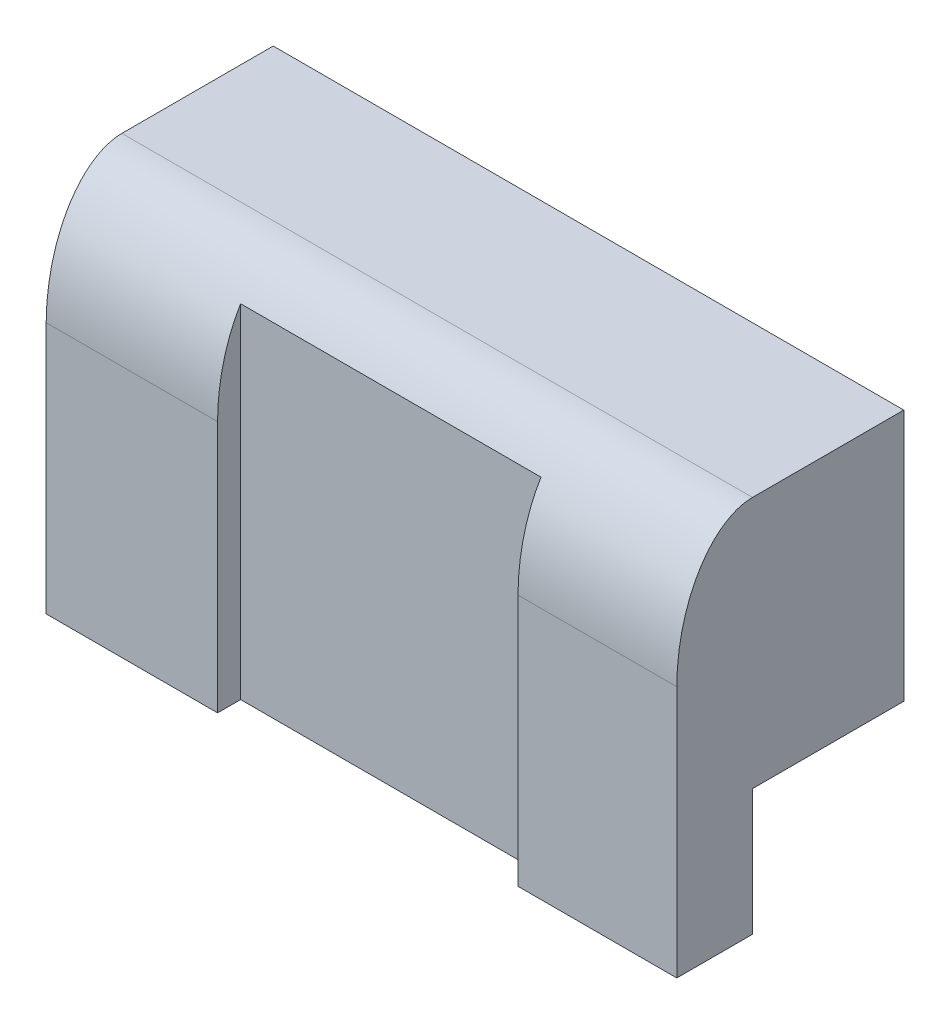
ISO-10303-21;
HEADER;
FILE_DESCRIPTION(('STEP AP214'),'2;1');
FILE_NAME('part.step','',(''),(''),'','','');
FILE_SCHEMA(('AUTOMOTIVE_DESIGN { 1 0 10303 214 1 1 1 1 }'));
ENDSEC;
DATA;
#1=APPLICATION_CONTEXT('core data for automotive mechanical design processes');
#2=APPLICATION_PROTOCOL_DEFINITION('international standard','automotive_design',2000,#1);
#3=PRODUCT_CONTEXT('',#1,'mechanical');
#4=PRODUCT('Part','Part','',(#3));
#5=PRODUCT_RELATED_PRODUCT_CATEGORY('part','',(#4));
#6=PRODUCT_DEFINITION_FORMATION('','',#4);
#7=PRODUCT_DEFINITION_CONTEXT('part definition',#1,'design');
#8=PRODUCT_DEFINITION('design','',#6,#7);
#9=PRODUCT_DEFINITION_SHAPE('','',#8);
#10=(LENGTH_UNIT() NAMED_UNIT(*) SI_UNIT(.MILLI.,.METRE.));
#11=(NAMED_UNIT(*) PLANE_ANGLE_UNIT() SI_UNIT($,.RADIAN.));
#12=(NAMED_UNIT(*) SI_UNIT($,.STERADIAN.) SOLID_ANGLE_UNIT());
#13=UNCERTAINTY_MEASURE_WITH_UNIT(LENGTH_MEASURE(1.E-05),#10,'distance_accuracy_value','');
#14=(GEOMETRIC_REPRESENTATION_CONTEXT(3) GLOBAL_UNCERTAINTY_ASSIGNED_CONTEXT((#13)) GLOBAL_UNIT_ASSIGNED_CONTEXT((#10,
#11,#12)) REPRESENTATION_CONTEXT('',''));
#15=CARTESIAN_POINT('',(0.,0.,0.));
#16=DIRECTION('',(0.,0.,1.));
#17=DIRECTION('',(1.,0.,0.));
#18=AXIS2_PLACEMENT_3D('',#15,#16,#17);
#19=CARTESIAN_POINT('',(25.,0.,0.));
#20=DIRECTION('',(0.,0.,-1.));
#21=DIRECTION('',(-1.,0.,0.));
#22=AXIS2_PLACEMENT_3D('',#19,#20,#21);
#23=PLANE('',#22);
#24=DIRECTION('',(-1.,0.,0.));
#25=VECTOR('',#24,1.);
#26=CARTESIAN_POINT('',(25.,0.,0.));
#27=LINE('',#26,#25);
#28=CARTESIAN_POINT('',(6.79485187038864,0.,0.));
#29=VERTEX_POINT('',#28);
#30=CARTESIAN_POINT('',(0.,0.,0.));
#31=VERTEX_POINT('',#30);
#32=EDGE_CURVE('E366',#29,#31,#27,.T.);
#33=ORIENTED_EDGE('',*,*,#32,.F.);
#34=DIRECTION('',(0.,1.,0.));
#35=VECTOR('',#34,1.);
#36=CARTESIAN_POINT('',(6.79485187038864,0.,0.));
#37=LINE('',#36,#35);
#38=CARTESIAN_POINT('',(6.79485187038864,10.,0.));
#39=VERTEX_POINT('',#38);
#40=EDGE_CURVE('E163',#29,#39,#37,.T.);
#41=ORIENTED_EDGE('',*,*,#40,.T.);
#42=CARTESIAN_POINT('',(-1.25,10.,0.));
#43=CARTESIAN_POINT('',(7.91666666666666,10.,0.));
#44=CARTESIAN_POINT('',(17.0833333333333,10.,0.));
#45=CARTESIAN_POINT('',(26.25,10.,0.));
#46=(BOUNDED_CURVE() B_SPLINE_CURVE(3,(#42,#43,#44,#45),.UNSPECIFIED.,.F.,
.F.) B_SPLINE_CURVE_WITH_KNOTS((4,4),(-0.00125,0.02625),
.UNSPECIFIED.) CURVE() GEOMETRIC_REPRESENTATION_ITEM() RATIONAL_B_SPLINE_CURVE((1.,1.,1.,1.)) REPRESENTATION_ITEM(''));
#47=CARTESIAN_POINT('',(0.,10.,0.));
#48=VERTEX_POINT('',#47);
#49=EDGE_CURVE('E361',#39,#48,#46,.F.);
#50=ORIENTED_EDGE('',*,*,#49,.T.);
#51=DIRECTION('',(0.,-1.,0.));
#52=VECTOR('',#51,1.);
#53=CARTESIAN_POINT('',(0.,0.,0.));
#54=LINE('',#53,#52);
#55=EDGE_CURVE('E228',#48,#31,#54,.T.);
#56=ORIENTED_EDGE('',*,*,#55,.T.);
#57=EDGE_LOOP('',(#33,#41,#50,#56));
#58=FACE_BOUND('',#57,.T.);
#59=ADVANCED_FACE('F46',(#58),#23,.F.);
#60=CARTESIAN_POINT('',(25.,0.,-3.));
#61=DIRECTION('',(0.,0.,1.));
#62=DIRECTION('',(1.,0.,0.));
#63=AXIS2_PLACEMENT_3D('',#60,#61,#62);
#64=PLANE('',#63);
#65=DIRECTION('',(-1.,0.,0.));
#66=VECTOR('',#65,1.);
#67=CARTESIAN_POINT('',(0.,5.,-3.));
#68=LINE('',#67,#66);
#69=CARTESIAN_POINT('',(25.,5.,-3.));
#70=VERTEX_POINT('',#69);
#71=CARTESIAN_POINT('',(0.,5.,-3.));
#72=VERTEX_POINT('',#71);
#73=EDGE_CURVE('E209',#70,#72,#68,.T.);
#74=ORIENTED_EDGE('',*,*,#73,.F.);
#75=DIRECTION('',(0.,1.,0.));
#76=VECTOR('',#75,1.);
#77=CARTESIAN_POINT('',(25.,0.,-3.));
#78=LINE('',#77,#76);
#79=CARTESIAN_POINT('',(25.,0.,-3.));
#80=VERTEX_POINT('',#79);
#81=EDGE_CURVE('E379',#80,#70,#78,.T.);
#82=ORIENTED_EDGE('',*,*,#81,.F.);
#83=DIRECTION('',(-1.,0.,0.));
#84=VECTOR('',#83,1.);
#85=CARTESIAN_POINT('',(25.,0.,-3.));
#86=LINE('',#85,#84);
#87=CARTESIAN_POINT('',(0.,0.,-3.));
#88=VERTEX_POINT('',#87);
#89=EDGE_CURVE('E367',#80,#88,#86,.T.);
#90=ORIENTED_EDGE('',*,*,#89,.T.);
#91=DIRECTION('',(0.,1.,0.));
#92=VECTOR('',#91,1.);
#93=CARTESIAN_POINT('',(0.,0.,-3.));
#94=LINE('',#93,#92);
#95=EDGE_CURVE('E373',#88,#72,#94,.T.);
#96=ORIENTED_EDGE('',*,*,#95,.T.);
#97=EDGE_LOOP('',(#74,#82,#90,#96));
#98=FACE_BOUND('',#97,.T.);
#99=ADVANCED_FACE('F261',(#98),#64,.F.);
#100=CARTESIAN_POINT('',(-1.25,10.,0.));
#101=CARTESIAN_POINT('',(7.91666666666666,10.,0.));
#102=CARTESIAN_POINT('',(17.0833333333333,10.,0.));
#103=CARTESIAN_POINT('',(26.25,10.,0.));
#104=(BOUNDED_CURVE() B_SPLINE_CURVE(3,(#100,#101,#102,#103),.UNSPECIFIED.,.F.,
.F.) B_SPLINE_CURVE_WITH_KNOTS((4,4),(-0.00125,0.02625),
.UNSPECIFIED.) CURVE() GEOMETRIC_REPRESENTATION_ITEM() RATIONAL_B_SPLINE_CURVE((1.,1.,1.,1.)) REPRESENTATION_ITEM(''));
#105=CARTESIAN_POINT('',(25.,10.,0.));
#106=VERTEX_POINT('',#105);
#107=CARTESIAN_POINT('',(18.7048192438084,10.,0.));
#108=VERTEX_POINT('',#107);
#109=EDGE_CURVE('E245',#106,#108,#104,.F.);
#110=ORIENTED_EDGE('',*,*,#109,.T.);
#111=DIRECTION('',(0.,-1.,0.));
#112=VECTOR('',#111,1.);
#113=CARTESIAN_POINT('',(18.7048192438084,0.,0.));
#114=LINE('',#113,#112);
#115=CARTESIAN_POINT('',(18.7048192438084,0.,0.));
#116=VERTEX_POINT('',#115);
#117=EDGE_CURVE('E71',#108,#116,#114,.T.);
#118=ORIENTED_EDGE('',*,*,#117,.T.);
#119=CARTESIAN_POINT('',(25.,0.,0.));
#120=VERTEX_POINT('',#119);
#121=EDGE_CURVE('E173',#120,#116,#27,.T.);
#122=ORIENTED_EDGE('',*,*,#121,.F.);
#123=DIRECTION('',(0.,-1.,0.));
#124=VECTOR('',#123,1.);
#125=CARTESIAN_POINT('',(25.,0.,0.));
#126=LINE('',#125,#124);
#127=EDGE_CURVE('E234',#106,#120,#126,.T.);
#128=ORIENTED_EDGE('',*,*,#127,.F.);
#129=EDGE_LOOP('',(#110,#118,#122,#128));
#130=FACE_BOUND('',#129,.T.);
#131=ADVANCED_FACE('F252',(#130),#23,.F.);
#132=CARTESIAN_POINT('',(25.,0.,0.));
#133=DIRECTION('',(0.,1.,0.));
#134=DIRECTION('',(0.,0.,1.));
#135=AXIS2_PLACEMENT_3D('',#132,#133,#134);
#136=PLANE('',#135);
#137=DIRECTION('',(-1.,0.,0.));
#138=VECTOR('',#137,1.);
#139=CARTESIAN_POINT('',(25.,0.,-0.912955283439043));
#140=LINE('',#139,#138);
#141=CARTESIAN_POINT('',(18.7048192438084,0.,-0.912955283439043));
#142=VERTEX_POINT('',#141);
#143=CARTESIAN_POINT('',(6.79485187038864,0.,-0.912955283439043));
#144=VERTEX_POINT('',#143);
#145=EDGE_CURVE('E153',#142,#144,#140,.T.);
#146=ORIENTED_EDGE('',*,*,#145,.T.);
#147=DIRECTION('',(0.,0.,1.));
#148=VECTOR('',#147,1.);
#149=CARTESIAN_POINT('',(6.79485187038864,0.,0.));
#150=LINE('',#149,#148);
#151=EDGE_CURVE('E181',#144,#29,#150,.T.);
#152=ORIENTED_EDGE('',*,*,#151,.T.);
#153=ORIENTED_EDGE('',*,*,#32,.T.);
#154=DIRECTION('',(0.,0.,-1.));
#155=VECTOR('',#154,1.);
#156=CARTESIAN_POINT('',(0.,0.,0.));
#157=LINE('',#156,#155);
#158=EDGE_CURVE('E375',#31,#88,#157,.T.);
#159=ORIENTED_EDGE('',*,*,#158,.T.);
#160=ORIENTED_EDGE('',*,*,#89,.F.);
#161=DIRECTION('',(0.,0.,-1.));
#162=VECTOR('',#161,1.);
#163=CARTESIAN_POINT('',(25.,0.,0.));
#164=LINE('',#163,#162);
#165=EDGE_CURVE('E231',#120,#80,#164,.T.);
#166=ORIENTED_EDGE('',*,*,#165,.F.);
#167=ORIENTED_EDGE('',*,*,#121,.T.);
#168=DIRECTION('',(0.,0.,-1.));
#169=VECTOR('',#168,1.);
#170=CARTESIAN_POINT('',(18.7048192438084,0.,0.));
#171=LINE('',#170,#169);
#172=EDGE_CURVE('E164',#116,#142,#171,.T.);
#173=ORIENTED_EDGE('',*,*,#172,.T.);
#174=EDGE_LOOP('',(#146,#152,#153,#159,#160,#166,#167,#173));
#175=FACE_BOUND('',#174,.T.);
#176=ADVANCED_FACE('F170',(#175),#136,.F.);
#177=CARTESIAN_POINT('',(25.,15.,0.));
#178=DIRECTION('',(0.,-1.,0.));
#179=DIRECTION('',(0.,0.,-1.));
#180=AXIS2_PLACEMENT_3D('',#177,#178,#179);
#181=PLANE('',#180);
#182=DIRECTION('',(0.,0.,1.));
#183=VECTOR('',#182,1.);
#184=CARTESIAN_POINT('',(0.,15.,0.));
#185=LINE('',#184,#183);
#186=CARTESIAN_POINT('',(0.,15.,-9.));
#187=VERTEX_POINT('',#186);
#188=CARTESIAN_POINT('',(0.,15.,-3.));
#189=VERTEX_POINT('',#188);
#190=EDGE_CURVE('E237',#187,#189,#185,.T.);
#191=ORIENTED_EDGE('',*,*,#190,.T.);
#192=CARTESIAN_POINT('',(26.25,15.,-3.));
#193=CARTESIAN_POINT('',(17.0833333333333,15.,-3.));
#194=CARTESIAN_POINT('',(7.91666666666666,15.,-3.));
#195=CARTESIAN_POINT('',(-1.25,15.,-3.));
#196=(BOUNDED_CURVE() B_SPLINE_CURVE(3,(#192,#193,#194,#195),.UNSPECIFIED.,.F.,
.F.) B_SPLINE_CURVE_WITH_KNOTS((4,4),(-0.00125,0.02625),
.UNSPECIFIED.) CURVE() GEOMETRIC_REPRESENTATION_ITEM() RATIONAL_B_SPLINE_CURVE((1.,1.,1.,1.)) REPRESENTATION_ITEM(''));
#197=CARTESIAN_POINT('',(25.,15.,-3.));
#198=VERTEX_POINT('',#197);
#199=EDGE_CURVE('E79',#189,#198,#196,.F.);
#200=ORIENTED_EDGE('',*,*,#199,.T.);
#201=DIRECTION('',(0.,0.,1.));
#202=VECTOR('',#201,1.);
#203=CARTESIAN_POINT('',(25.,15.,0.));
#204=LINE('',#203,#202);
#205=CARTESIAN_POINT('',(25.,15.,-9.));
#206=VERTEX_POINT('',#205);
#207=EDGE_CURVE('E370',#206,#198,#204,.T.);
#208=ORIENTED_EDGE('',*,*,#207,.F.);
#209=DIRECTION('',(1.,0.,0.));
#210=VECTOR('',#209,1.);
#211=CARTESIAN_POINT('',(0.,15.,-9.));
#212=LINE('',#211,#210);
#213=EDGE_CURVE('E213',#187,#206,#212,.T.);
#214=ORIENTED_EDGE('',*,*,#213,.F.);
#215=EDGE_LOOP('',(#191,#200,#208,#214));
#216=FACE_BOUND('',#215,.T.);
#217=ADVANCED_FACE('F264',(#216),#181,.F.);
#218=CARTESIAN_POINT('',(25.,0.,0.));
#219=DIRECTION('',(-1.,0.,0.));
#220=DIRECTION('',(0.,0.,1.));
#221=AXIS2_PLACEMENT_3D('',#218,#219,#220);
#222=PLANE('',#221);
#223=ORIENTED_EDGE('',*,*,#207,.T.);
#224=CARTESIAN_POINT('',(25.,10.,0.));
#225=CARTESIAN_POINT('',(25.,15.,0.));
#226=CARTESIAN_POINT('',(25.,15.,-3.));
#227=(BOUNDED_CURVE() B_SPLINE_CURVE(2,(#224,#225,#226),.UNSPECIFIED.,.F.,
.F.) B_SPLINE_CURVE_WITH_KNOTS((3,3),(0.,1.),
.UNSPECIFIED.) CURVE() GEOMETRIC_REPRESENTATION_ITEM() RATIONAL_B_SPLINE_CURVE((1.,
0.707106781186547,1.)) REPRESENTATION_ITEM(''));
#228=EDGE_CURVE('E288',#198,#106,#227,.F.);
#229=ORIENTED_EDGE('',*,*,#228,.T.);
#230=ORIENTED_EDGE('',*,*,#127,.T.);
#231=ORIENTED_EDGE('',*,*,#165,.T.);
#232=ORIENTED_EDGE('',*,*,#81,.T.);
#233=DIRECTION('',(0.,0.,1.));
#234=VECTOR('',#233,1.);
#235=CARTESIAN_POINT('',(25.,5.,-9.));
#236=LINE('',#235,#234);
#237=CARTESIAN_POINT('',(25.,5.,-9.));
#238=VERTEX_POINT('',#237);
#239=EDGE_CURVE('E225',#238,#70,#236,.T.);
#240=ORIENTED_EDGE('',*,*,#239,.F.);
#241=DIRECTION('',(0.,-1.,0.));
#242=VECTOR('',#241,1.);
#243=CARTESIAN_POINT('',(25.,15.,-9.));
#244=LINE('',#243,#242);
#245=EDGE_CURVE('E216',#206,#238,#244,.T.);
#246=ORIENTED_EDGE('',*,*,#245,.F.);
#247=EDGE_LOOP('',(#223,#229,#230,#231,#232,#240,#246));
#248=FACE_BOUND('',#247,.T.);
#249=ADVANCED_FACE('F271',(#248),#222,.F.);
#250=CARTESIAN_POINT('',(0.,0.,0.));
#251=DIRECTION('',(-1.,0.,0.));
#252=DIRECTION('',(0.,0.,1.));
#253=AXIS2_PLACEMENT_3D('',#250,#251,#252);
#254=PLANE('',#253);
#255=ORIENTED_EDGE('',*,*,#55,.F.);
#256=CARTESIAN_POINT('',(0.,15.,-3.));
#257=CARTESIAN_POINT('',(0.,15.,0.));
#258=CARTESIAN_POINT('',(0.,10.,0.));
#259=(BOUNDED_CURVE() B_SPLINE_CURVE(2,(#256,#257,#258),.UNSPECIFIED.,.F.,
.F.) B_SPLINE_CURVE_WITH_KNOTS((3,3),(0.,1.),
.UNSPECIFIED.) CURVE() GEOMETRIC_REPRESENTATION_ITEM() RATIONAL_B_SPLINE_CURVE((1.,
0.707106781186548,1.)) REPRESENTATION_ITEM(''));
#260=EDGE_CURVE('E358',#48,#189,#259,.F.);
#261=ORIENTED_EDGE('',*,*,#260,.T.);
#262=ORIENTED_EDGE('',*,*,#190,.F.);
#263=DIRECTION('',(0.,1.,0.));
#264=VECTOR('',#263,1.);
#265=CARTESIAN_POINT('',(0.,15.,-9.));
#266=LINE('',#265,#264);
#267=CARTESIAN_POINT('',(0.,5.,-9.));
#268=VERTEX_POINT('',#267);
#269=EDGE_CURVE('E210',#268,#187,#266,.T.);
#270=ORIENTED_EDGE('',*,*,#269,.F.);
#271=DIRECTION('',(0.,0.,1.));
#272=VECTOR('',#271,1.);
#273=CARTESIAN_POINT('',(0.,5.,-9.));
#274=LINE('',#273,#272);
#275=EDGE_CURVE('E220',#268,#72,#274,.T.);
#276=ORIENTED_EDGE('',*,*,#275,.T.);
#277=ORIENTED_EDGE('',*,*,#95,.F.);
#278=ORIENTED_EDGE('',*,*,#158,.F.);
#279=EDGE_LOOP('',(#255,#261,#262,#270,#276,#277,#278));
#280=FACE_BOUND('',#279,.T.);
#281=ADVANCED_FACE('F272',(#280),#254,.T.);
#282=CARTESIAN_POINT('',(0.,5.,-9.));
#283=DIRECTION('',(0.,1.,0.));
#284=DIRECTION('',(-1.,0.,0.));
#285=AXIS2_PLACEMENT_3D('',#282,#283,#284);
#286=PLANE('',#285);
#287=CARTESIAN_POINT('',(3.,5.,-6.));
#288=DIRECTION('',(0.,-1.,0.));
#289=DIRECTION('',(0.,0.,-1.));
#290=AXIS2_PLACEMENT_3D('',#287,#288,#289);
#291=CIRCLE('',#290,1.5);
#292=CARTESIAN_POINT('',(3.,5.,-7.5));
#293=VERTEX_POINT('',#292);
#294=EDGE_CURVE('E185',#293,#293,#291,.T.);
#295=ORIENTED_EDGE('',*,*,#294,.F.);
#296=EDGE_LOOP('',(#295));
#297=FACE_BOUND('',#296,.T.);
#298=CARTESIAN_POINT('',(18.,5.,-6.));
#299=DIRECTION('',(0.,-1.,0.));
#300=DIRECTION('',(0.,0.,-1.));
#301=AXIS2_PLACEMENT_3D('',#298,#299,#300);
#302=CIRCLE('',#301,1.5);
#303=CARTESIAN_POINT('',(18.,5.,-7.5));
#304=VERTEX_POINT('',#303);
#305=EDGE_CURVE('E191',#304,#304,#302,.T.);
#306=ORIENTED_EDGE('',*,*,#305,.F.);
#307=EDGE_LOOP('',(#306));
#308=FACE_BOUND('',#307,.T.);
#309=CARTESIAN_POINT('',(7.,5.,-6.));
#310=DIRECTION('',(0.,-1.,0.));
#311=DIRECTION('',(0.,0.,-1.));
#312=AXIS2_PLACEMENT_3D('',#309,#310,#311);
#313=CIRCLE('',#312,1.5);
#314=CARTESIAN_POINT('',(7.,5.,-7.5));
#315=VERTEX_POINT('',#314);
#316=EDGE_CURVE('E197',#315,#315,#313,.T.);
#317=ORIENTED_EDGE('',*,*,#316,.F.);
#318=EDGE_LOOP('',(#317));
#319=FACE_BOUND('',#318,.T.);
#320=CARTESIAN_POINT('',(22.,5.,-6.));
#321=DIRECTION('',(0.,-1.,0.));
#322=DIRECTION('',(0.,0.,-1.));
#323=AXIS2_PLACEMENT_3D('',#320,#321,#322);
#324=CIRCLE('',#323,1.5);
#325=CARTESIAN_POINT('',(22.,5.,-7.5));
#326=VERTEX_POINT('',#325);
#327=EDGE_CURVE('E203',#326,#326,#324,.T.);
#328=ORIENTED_EDGE('',*,*,#327,.F.);
#329=EDGE_LOOP('',(#328));
#330=FACE_BOUND('',#329,.T.);
#331=ORIENTED_EDGE('',*,*,#73,.T.);
#332=ORIENTED_EDGE('',*,*,#275,.F.);
#333=DIRECTION('',(-1.,0.,0.));
#334=VECTOR('',#333,1.);
#335=CARTESIAN_POINT('',(0.,5.,-9.));
#336=LINE('',#335,#334);
#337=EDGE_CURVE('E218',#238,#268,#336,.T.);
#338=ORIENTED_EDGE('',*,*,#337,.F.);
#339=ORIENTED_EDGE('',*,*,#239,.T.);
#340=EDGE_LOOP('',(#331,#332,#338,#339));
#341=FACE_BOUND('',#340,.T.);
#342=ADVANCED_FACE('F302',(#297,#308,#319,#330,#341),#286,.F.);
#343=CARTESIAN_POINT('',(0.,0.,-9.));
#344=DIRECTION('',(0.,0.,1.));
#345=DIRECTION('',(1.,0.,0.));
#346=AXIS2_PLACEMENT_3D('',#343,#344,#345);
#347=PLANE('',#346);
#348=ORIENTED_EDGE('',*,*,#269,.T.);
#349=ORIENTED_EDGE('',*,*,#213,.T.);
#350=ORIENTED_EDGE('',*,*,#245,.T.);
#351=ORIENTED_EDGE('',*,*,#337,.T.);
#352=EDGE_LOOP('',(#348,#349,#350,#351));
#353=FACE_BOUND('',#352,.T.);
#354=ADVANCED_FACE('F305',(#353),#347,.F.);
#355=CARTESIAN_POINT('',(26.25,10.,0.));
#356=CARTESIAN_POINT('',(17.0833333333333,10.,0.));
#357=CARTESIAN_POINT('',(7.91666666666666,10.,0.));
#358=CARTESIAN_POINT('',(-1.25,10.,0.));
#359=CARTESIAN_POINT('',(26.25,15.,0.));
#360=CARTESIAN_POINT('',(17.0833333333333,15.,0.));
#361=CARTESIAN_POINT('',(7.91666666666667,15.,0.));
#362=CARTESIAN_POINT('',(-1.25,15.,0.));
#363=CARTESIAN_POINT('',(26.25,15.,-3.));
#364=CARTESIAN_POINT('',(17.0833333333333,15.,-3.));
#365=CARTESIAN_POINT('',(7.91666666666666,15.,-3.));
#366=CARTESIAN_POINT('',(-1.25,15.,-3.));
#367=(BOUNDED_SURFACE() B_SPLINE_SURFACE(2,3,((#355,#356,#357,#358),(#359,#360,#361,#362),(#363,
#364,#365,#366)),.UNSPECIFIED.,.F.,.F.,.F.) B_SPLINE_SURFACE_WITH_KNOTS((3,3),(4,4),(0.,1.),
(-0.00125,0.02625),
.UNSPECIFIED.) GEOMETRIC_REPRESENTATION_ITEM() RATIONAL_B_SPLINE_SURFACE(((1.,1.,1.,1.),
(0.707106781186548,0.707106781186548,0.707106781186548,0.707106781186548),(1.,1.,1.,1.))) REPRESENTATION_ITEM('') SURFACE());
#368=CARTESIAN_POINT('',(6.79485187038864,13.5917514881999,-0.912955283439043));
#369=CARTESIAN_POINT('',(6.79485187038864,13.5033968909196,-0.858239775167897));
#370=CARTESIAN_POINT('',(6.79485187038864,13.4132329807096,-0.806525080585709));
#371=CARTESIAN_POINT('',(6.79485187038864,13.2300666310542,-0.70883834382707));
#372=CARTESIAN_POINT('',(6.79485187038864,13.1370701081524,-0.662855233173692));
#373=CARTESIAN_POINT('',(6.79485187038864,12.948710842066,-0.576180863441645));
#374=CARTESIAN_POINT('',(6.79485187038864,12.8533492151792,-0.535487162375623));
#375=CARTESIAN_POINT('',(6.79485187038864,12.6623174336373,-0.459727817393185));
#376=CARTESIAN_POINT('',(6.79485187038864,12.5666807716839,-0.424577440073862));
#377=CARTESIAN_POINT('',(6.79485187038864,12.3738144701227,-0.358819983922193));
#378=CARTESIAN_POINT('',(6.79485187038864,12.2765841210384,-0.328214993153118));
#379=CARTESIAN_POINT('',(6.79485187038864,12.0808463061933,-0.271358354633539));
#380=CARTESIAN_POINT('',(6.79485187038864,11.9823386428535,-0.245107389251512));
#381=CARTESIAN_POINT('',(6.79485187038864,11.7816446807211,-0.19614476643137));
#382=CARTESIAN_POINT('',(6.79485187038864,11.6794306364864,-0.173547093581752));
#383=CARTESIAN_POINT('',(6.79485187038864,11.4741724282957,-0.132620842182377));
#384=CARTESIAN_POINT('',(6.79485187038864,11.3711284109301,-0.114291526147184));
#385=CARTESIAN_POINT('',(6.79485187038864,11.1643893034042,-0.0817775670182781));
#386=CARTESIAN_POINT('',(6.79485187038864,11.0606942066724,-0.0675929658266631));
#387=CARTESIAN_POINT('',(6.79485187038864,10.8509289323209,-0.0430562854189325));
#388=CARTESIAN_POINT('',(6.79485187038864,10.7448500124451,-0.032779077148555));
#389=CARTESIAN_POINT('',(6.79485187038864,10.5323768601193,-0.0163614096676779));
#390=CARTESIAN_POINT('',(6.79485187038864,10.4259826373092,-0.0102208252698124));
#391=CARTESIAN_POINT('',(6.79485187038864,10.213058448156,-0.00204291298936419));
#392=CARTESIAN_POINT('',(6.79485187038864,10.1065285145289,-4.73466876290641E-06));
#393=CARTESIAN_POINT('',(6.79485187038864,10.,0.));
#394=B_SPLINE_CURVE_WITH_KNOTS('',3,(#368,#369,#370,#371,#372,#373,#374,#375,#376,#377,#378,
#379,#380,#381,#382,#383,#384,#385,#386,#387,#388,#389,#390,#391,#392,#393),.UNSPECIFIED.,.F.,
.F.,(4,2,2,2,2,2,2,2,2,2,2,2,4),(0.,0.311654118552605,0.622696745523616,0.933595257992732,
1.23914854793192,1.54484177188057,1.85058285928959,2.16453490239327,2.47843266064129,
2.79233359221252,3.11197786578846,3.43161246547966,3.75118079737129),.UNSPECIFIED.);
#395=CARTESIAN_POINT('',(6.79485187038864,13.5917514881999,-0.912955283439043));
#396=VERTEX_POINT('',#395);
#397=EDGE_CURVE('E12',#396,#39,#394,.T.);
#398=DIRECTION('',(-1.,0.,0.));
#399=VECTOR('',#398,1.);
#400=CARTESIAN_POINT('',(12.5,13.5917514881999,-0.912955283439043));
#401=LINE('',#400,#399);
#402=CARTESIAN_POINT('',(18.7048192438084,13.5917514881999,-0.912955283439043));
#403=VERTEX_POINT('',#402);
#404=EDGE_CURVE('E64',#403,#396,#401,.T.);
#405=CARTESIAN_POINT('',(18.7048192438084,10.,0.));
#406=CARTESIAN_POINT('',(18.7048192438084,10.142178387985,-1.52312112982762E-05));
#407=CARTESIAN_POINT('',(18.7048192438084,10.2843626755596,-0.00363946714192033));
#408=CARTESIAN_POINT('',(18.7048192438084,10.5686374950977,-0.0182286520710286));
#409=CARTESIAN_POINT('',(18.7048192438084,10.7107272741869,-0.0292082306453334));
#410=CARTESIAN_POINT('',(18.7048192438084,10.9942420150547,-0.0586425243648471));
#411=CARTESIAN_POINT('',(18.7048192438084,11.1356664070355,-0.0771027653076121));
#412=CARTESIAN_POINT('',(18.7048192438084,11.4136739810413,-0.1211461336976));
#413=CARTESIAN_POINT('',(18.7048192438084,11.5502880821327,-0.146533709481441));
#414=CARTESIAN_POINT('',(18.7048192438084,11.8218130326001,-0.204889808872918));
#415=CARTESIAN_POINT('',(18.7048192438084,11.956724902089,-0.237853540009533));
#416=CARTESIAN_POINT('',(18.7048192438084,12.2242548909206,-0.311734835849067));
#417=CARTESIAN_POINT('',(18.7048192438084,12.3568742903824,-0.352647794453158));
#418=CARTESIAN_POINT('',(18.7048192438084,12.6791987357617,-0.463589128458956));
#419=CARTESIAN_POINT('',(18.7048192438084,12.8673292078763,-0.538383093550795));
#420=CARTESIAN_POINT('',(18.7048192438084,13.1126743702508,-0.651757629413608));
#421=CARTESIAN_POINT('',(18.7048192438084,13.1740546207438,-0.681504954867072));
#422=CARTESIAN_POINT('',(18.7048192438084,13.2956265534701,-0.743392731138354));
#423=CARTESIAN_POINT('',(18.7048192438084,13.3558179195152,-0.775533808022918));
#424=CARTESIAN_POINT('',(18.7048192438084,13.474856444057,-0.842334338994641));
#425=CARTESIAN_POINT('',(18.7048192438084,13.5337023425949,-0.876996035986982));
#426=CARTESIAN_POINT('',(18.7048192438084,13.5917514881999,-0.912955283439044));
#427=B_SPLINE_CURVE_WITH_KNOTS('',3,(#405,#406,#407,#408,#409,#410,#411,#412,#413,#414,#415,
#416,#417,#418,#419,#420,#421,#422,#423,#424,#425,#426),.UNSPECIFIED.,.F.,.F.,(4,2,2,2,2,2,2,2,
2,2,4),(0.,0.426498445435446,0.853847713226477,1.28151323144501,1.69817181648926,
2.11456755648514,2.53072273591138,3.13683530194909,3.34142643410994,3.54607126465461,
3.750900475158),.UNSPECIFIED.);
#428=EDGE_CURVE('E167',#108,#403,#427,.T.);
#429=ORIENTED_EDGE('',*,*,#397,.F.);
#430=ORIENTED_EDGE('',*,*,#404,.F.);
#431=ORIENTED_EDGE('',*,*,#428,.F.);
#432=ORIENTED_EDGE('',*,*,#109,.F.);
#433=ORIENTED_EDGE('',*,*,#228,.F.);
#434=ORIENTED_EDGE('',*,*,#199,.F.);
#435=ORIENTED_EDGE('',*,*,#260,.F.);
#436=ORIENTED_EDGE('',*,*,#49,.F.);
#437=EDGE_LOOP('',(#429,#430,#431,#432,#433,#434,#435,#436));
#438=FACE_BOUND('',#437,.T.);
#439=ADVANCED_FACE('F49',(#438),#367,.T.);
#440=CARTESIAN_POINT('',(22.,9.99999999999999,-6.));
#441=DIRECTION('',(0.,-1.,0.));
#442=DIRECTION('',(0.,0.,-1.));
#443=AXIS2_PLACEMENT_3D('',#440,#441,#442);
#444=CONICAL_SURFACE('',#443,1.5,1.02974425867665);
#445=CARTESIAN_POINT('',(22.,10.9012909285413,-6.));
#446=VERTEX_POINT('',#445);
#447=VERTEX_LOOP('',#446);
#448=FACE_BOUND('',#447,.T.);
#449=CARTESIAN_POINT('',(22.,9.99999999999999,-6.));
#450=DIRECTION('',(0.,-1.,0.));
#451=DIRECTION('',(0.,0.,-1.));
#452=AXIS2_PLACEMENT_3D('',#449,#450,#451);
#453=CIRCLE('',#452,1.5);
#454=CARTESIAN_POINT('',(22.,9.99999999999999,-7.5));
#455=VERTEX_POINT('',#454);
#456=EDGE_CURVE('E206',#455,#455,#453,.T.);
#457=ORIENTED_EDGE('',*,*,#456,.T.);
#458=EDGE_LOOP('',(#457));
#459=FACE_BOUND('',#458,.T.);
#460=ADVANCED_FACE('F310',(#448,#459),#444,.F.);
#461=CARTESIAN_POINT('',(22.,5.,-6.));
#462=DIRECTION('',(0.,-1.,0.));
#463=DIRECTION('',(0.,0.,-1.));
#464=AXIS2_PLACEMENT_3D('',#461,#462,#463);
#465=CYLINDRICAL_SURFACE('',#464,1.5);
#466=ORIENTED_EDGE('',*,*,#456,.F.);
#467=EDGE_LOOP('',(#466));
#468=FACE_BOUND('',#467,.T.);
#469=ORIENTED_EDGE('',*,*,#327,.T.);
#470=EDGE_LOOP('',(#469));
#471=FACE_BOUND('',#470,.T.);
#472=ADVANCED_FACE('F313',(#468,#471),#465,.F.);
#473=CARTESIAN_POINT('',(7.,10.,-6.));
#474=DIRECTION('',(0.,-1.,0.));
#475=DIRECTION('',(0.,0.,-1.));
#476=AXIS2_PLACEMENT_3D('',#473,#474,#475);
#477=CONICAL_SURFACE('',#476,1.5,1.02974425867665);
#478=CARTESIAN_POINT('',(7.,10.9012909285413,-6.));
#479=VERTEX_POINT('',#478);
#480=VERTEX_LOOP('',#479);
#481=FACE_BOUND('',#480,.T.);
#482=CARTESIAN_POINT('',(7.,10.,-6.));
#483=DIRECTION('',(0.,-1.,0.));
#484=DIRECTION('',(0.,0.,-1.));
#485=AXIS2_PLACEMENT_3D('',#482,#483,#484);
#486=CIRCLE('',#485,1.5);
#487=CARTESIAN_POINT('',(7.,10.,-7.5));
#488=VERTEX_POINT('',#487);
#489=EDGE_CURVE('E200',#488,#488,#486,.T.);
#490=ORIENTED_EDGE('',*,*,#489,.T.);
#491=EDGE_LOOP('',(#490));
#492=FACE_BOUND('',#491,.T.);
#493=ADVANCED_FACE('F317',(#481,#492),#477,.F.);
#494=CARTESIAN_POINT('',(7.,5.,-6.));
#495=DIRECTION('',(0.,-1.,0.));
#496=DIRECTION('',(0.,0.,-1.));
#497=AXIS2_PLACEMENT_3D('',#494,#495,#496);
#498=CYLINDRICAL_SURFACE('',#497,1.5);
#499=ORIENTED_EDGE('',*,*,#489,.F.);
#500=EDGE_LOOP('',(#499));
#501=FACE_BOUND('',#500,.T.);
#502=ORIENTED_EDGE('',*,*,#316,.T.);
#503=EDGE_LOOP('',(#502));
#504=FACE_BOUND('',#503,.T.);
#505=ADVANCED_FACE('F321',(#501,#504),#498,.F.);
#506=CARTESIAN_POINT('',(18.,10.,-6.));
#507=DIRECTION('',(0.,-1.,0.));
#508=DIRECTION('',(0.,0.,-1.));
#509=AXIS2_PLACEMENT_3D('',#506,#507,#508);
#510=CONICAL_SURFACE('',#509,1.5,1.02974425867665);
#511=CARTESIAN_POINT('',(18.,10.9012909285413,-6.));
#512=VERTEX_POINT('',#511);
#513=VERTEX_LOOP('',#512);
#514=FACE_BOUND('',#513,.T.);
#515=CARTESIAN_POINT('',(18.,10.,-6.));
#516=DIRECTION('',(0.,-1.,0.));
#517=DIRECTION('',(0.,0.,-1.));
#518=AXIS2_PLACEMENT_3D('',#515,#516,#517);
#519=CIRCLE('',#518,1.5);
#520=CARTESIAN_POINT('',(18.,10.,-7.5));
#521=VERTEX_POINT('',#520);
#522=EDGE_CURVE('E194',#521,#521,#519,.T.);
#523=ORIENTED_EDGE('',*,*,#522,.T.);
#524=EDGE_LOOP('',(#523));
#525=FACE_BOUND('',#524,.T.);
#526=ADVANCED_FACE('F325',(#514,#525),#510,.F.);
#527=CARTESIAN_POINT('',(18.,5.,-6.));
#528=DIRECTION('',(0.,-1.,0.));
#529=DIRECTION('',(0.,0.,-1.));
#530=AXIS2_PLACEMENT_3D('',#527,#528,#529);
#531=CYLINDRICAL_SURFACE('',#530,1.5);
#532=ORIENTED_EDGE('',*,*,#522,.F.);
#533=EDGE_LOOP('',(#532));
#534=FACE_BOUND('',#533,.T.);
#535=ORIENTED_EDGE('',*,*,#305,.T.);
#536=EDGE_LOOP('',(#535));
#537=FACE_BOUND('',#536,.T.);
#538=ADVANCED_FACE('F329',(#534,#537),#531,.F.);
#539=CARTESIAN_POINT('',(3.,10.,-6.));
#540=DIRECTION('',(0.,-1.,0.));
#541=DIRECTION('',(0.,0.,-1.));
#542=AXIS2_PLACEMENT_3D('',#539,#540,#541);
#543=CONICAL_SURFACE('',#542,1.5,1.02974425867665);
#544=CARTESIAN_POINT('',(3.,10.9012909285413,-6.));
#545=VERTEX_POINT('',#544);
#546=VERTEX_LOOP('',#545);
#547=FACE_BOUND('',#546,.T.);
#548=CARTESIAN_POINT('',(3.,10.,-6.));
#549=DIRECTION('',(0.,-1.,0.));
#550=DIRECTION('',(0.,0.,-1.));
#551=AXIS2_PLACEMENT_3D('',#548,#549,#550);
#552=CIRCLE('',#551,1.5);
#553=CARTESIAN_POINT('',(3.,10.,-7.5));
#554=VERTEX_POINT('',#553);
#555=EDGE_CURVE('E188',#554,#554,#552,.T.);
#556=ORIENTED_EDGE('',*,*,#555,.T.);
#557=EDGE_LOOP('',(#556));
#558=FACE_BOUND('',#557,.T.);
#559=ADVANCED_FACE('F333',(#547,#558),#543,.F.);
#560=CARTESIAN_POINT('',(3.,5.,-6.));
#561=DIRECTION('',(0.,-1.,0.));
#562=DIRECTION('',(0.,0.,-1.));
#563=AXIS2_PLACEMENT_3D('',#560,#561,#562);
#564=CYLINDRICAL_SURFACE('',#563,1.5);
#565=ORIENTED_EDGE('',*,*,#555,.F.);
#566=EDGE_LOOP('',(#565));
#567=FACE_BOUND('',#566,.T.);
#568=ORIENTED_EDGE('',*,*,#294,.T.);
#569=EDGE_LOOP('',(#568));
#570=FACE_BOUND('',#569,.T.);
#571=ADVANCED_FACE('F337',(#567,#570),#564,.F.);
#572=CARTESIAN_POINT('',(6.79485187038864,-3.,1.11728990072324));
#573=DIRECTION('',(-1.,0.,0.));
#574=DIRECTION('',(0.,0.,1.));
#575=AXIS2_PLACEMENT_3D('',#572,#573,#574);
#576=PLANE('',#575);
#577=DIRECTION('',(0.,1.,0.));
#578=VECTOR('',#577,1.);
#579=CARTESIAN_POINT('',(6.79485187038864,-3.,-0.912955283439043));
#580=LINE('',#579,#578);
#581=EDGE_CURVE('E159',#144,#396,#580,.T.);
#582=ORIENTED_EDGE('',*,*,#581,.T.);
#583=ORIENTED_EDGE('',*,*,#397,.T.);
#584=ORIENTED_EDGE('',*,*,#40,.F.);
#585=ORIENTED_EDGE('',*,*,#151,.F.);
#586=EDGE_LOOP('',(#582,#583,#584,#585));
#587=FACE_BOUND('',#586,.T.);
#588=ADVANCED_FACE('F340',(#587),#576,.F.);
#589=CARTESIAN_POINT('',(6.79485187038864,-3.,-0.912955283439043));
#590=DIRECTION('',(0.,0.,-1.));
#591=DIRECTION('',(-1.,0.,0.));
#592=AXIS2_PLACEMENT_3D('',#589,#590,#591);
#593=PLANE('',#592);
#594=DIRECTION('',(0.,1.,0.));
#595=VECTOR('',#594,1.);
#596=CARTESIAN_POINT('',(18.7048192438084,-3.,-0.912955283439043));
#597=LINE('',#596,#595);
#598=EDGE_CURVE('E156',#142,#403,#597,.T.);
#599=ORIENTED_EDGE('',*,*,#598,.T.);
#600=ORIENTED_EDGE('',*,*,#404,.T.);
#601=ORIENTED_EDGE('',*,*,#581,.F.);
#602=ORIENTED_EDGE('',*,*,#145,.F.);
#603=EDGE_LOOP('',(#599,#600,#601,#602));
#604=FACE_BOUND('',#603,.T.);
#605=ADVANCED_FACE('F155',(#604),#593,.F.);
#606=CARTESIAN_POINT('',(18.7048192438084,-3.,1.11728990072324));
#607=DIRECTION('',(1.,0.,0.));
#608=DIRECTION('',(0.,0.,-1.));
#609=AXIS2_PLACEMENT_3D('',#606,#607,#608);
#610=PLANE('',#609);
#611=ORIENTED_EDGE('',*,*,#117,.F.);
#612=ORIENTED_EDGE('',*,*,#428,.T.);
#613=ORIENTED_EDGE('',*,*,#598,.F.);
#614=ORIENTED_EDGE('',*,*,#172,.F.);
#615=EDGE_LOOP('',(#611,#612,#613,#614));
#616=FACE_BOUND('',#615,.T.);
#617=ADVANCED_FACE('F166',(#616),#610,.F.);
#618=CLOSED_SHELL('',(#59,#99,#131,#176,#217,#249,#281,#342,#354,#439,#460,#472,#493,#505,#526,
#538,#559,#571,#588,#605,#617));
#619=MANIFOLD_SOLID_BREP('B2',#618);
#620=ADVANCED_BREP_SHAPE_REPRESENTATION('',(#18,#619),#14);
#621=SHAPE_DEFINITION_REPRESENTATION(#9,#620);
ENDSEC;
END-ISO-10303-21;
